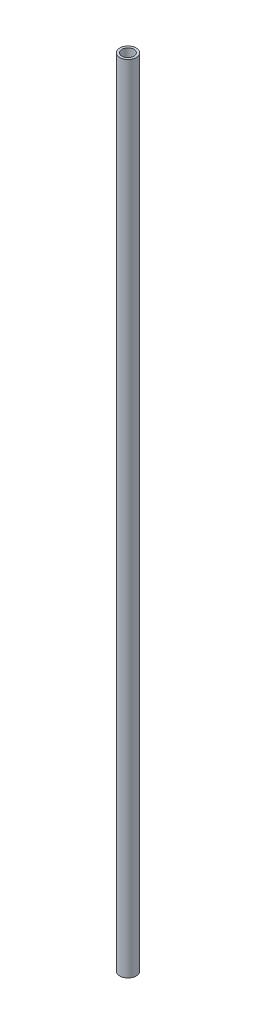
ISO-10303-21;
HEADER;
FILE_DESCRIPTION(('STEP AP214'),'2;1');
FILE_NAME('part.step','',(''),(''),'','','');
FILE_SCHEMA(('AUTOMOTIVE_DESIGN { 1 0 10303 214 1 1 1 1 }'));
ENDSEC;
DATA;
#1=APPLICATION_CONTEXT('core data for automotive mechanical design processes');
#2=APPLICATION_PROTOCOL_DEFINITION('international standard','automotive_design',2000,#1);
#3=PRODUCT_CONTEXT('',#1,'mechanical');
#4=PRODUCT('Part','Part','',(#3));
#5=PRODUCT_RELATED_PRODUCT_CATEGORY('part','',(#4));
#6=PRODUCT_DEFINITION_FORMATION('','',#4);
#7=PRODUCT_DEFINITION_CONTEXT('part definition',#1,'design');
#8=PRODUCT_DEFINITION('design','',#6,#7);
#9=PRODUCT_DEFINITION_SHAPE('','',#8);
#10=(LENGTH_UNIT() NAMED_UNIT(*) SI_UNIT(.MILLI.,.METRE.));
#11=(NAMED_UNIT(*) PLANE_ANGLE_UNIT() SI_UNIT($,.RADIAN.));
#12=(NAMED_UNIT(*) SI_UNIT($,.STERADIAN.) SOLID_ANGLE_UNIT());
#13=UNCERTAINTY_MEASURE_WITH_UNIT(LENGTH_MEASURE(1.E-05),#10,'distance_accuracy_value','');
#14=(GEOMETRIC_REPRESENTATION_CONTEXT(3) GLOBAL_UNCERTAINTY_ASSIGNED_CONTEXT((#13)) GLOBAL_UNIT_ASSIGNED_CONTEXT((#10,
#11,#12)) REPRESENTATION_CONTEXT('',''));
#15=CARTESIAN_POINT('',(0.,0.,0.));
#16=DIRECTION('',(0.,0.,1.));
#17=DIRECTION('',(1.,0.,0.));
#18=AXIS2_PLACEMENT_3D('',#15,#16,#17);
#19=CARTESIAN_POINT('',(0.,304.8,0.));
#20=DIRECTION('',(0.,1.,0.));
#21=DIRECTION('',(0.,0.,1.));
#22=AXIS2_PLACEMENT_3D('',#19,#20,#21);
#23=PLANE('',#22);
#24=CARTESIAN_POINT('',(0.,304.8,0.));
#25=DIRECTION('',(0.,1.,0.));
#26=DIRECTION('',(0.,0.,1.));
#27=AXIS2_PLACEMENT_3D('',#24,#25,#26);
#28=CIRCLE('',#27,3.175);
#29=CARTESIAN_POINT('',(0.,304.8,3.175));
#30=VERTEX_POINT('',#29);
#31=EDGE_CURVE('E10',#30,#30,#28,.T.);
#32=ORIENTED_EDGE('',*,*,#31,.T.);
#33=EDGE_LOOP('',(#32));
#34=FACE_BOUND('',#33,.T.);
#35=CARTESIAN_POINT('',(0.,304.8,0.));
#36=DIRECTION('',(0.,1.,0.));
#37=DIRECTION('',(0.,0.,1.));
#38=AXIS2_PLACEMENT_3D('',#35,#36,#37);
#39=CIRCLE('',#38,2.286);
#40=CARTESIAN_POINT('',(0.,304.8,2.286));
#41=VERTEX_POINT('',#40);
#42=EDGE_CURVE('E50',#41,#41,#39,.T.);
#43=ORIENTED_EDGE('',*,*,#42,.F.);
#44=EDGE_LOOP('',(#43));
#45=FACE_BOUND('',#44,.T.);
#46=ADVANCED_FACE('F37',(#34,#45),#23,.T.);
#47=CARTESIAN_POINT('',(0.,0.,0.));
#48=DIRECTION('',(0.,1.,0.));
#49=DIRECTION('',(0.,0.,1.));
#50=AXIS2_PLACEMENT_3D('',#47,#48,#49);
#51=PLANE('',#50);
#52=CARTESIAN_POINT('',(0.,0.,0.));
#53=DIRECTION('',(0.,1.,0.));
#54=DIRECTION('',(0.,0.,1.));
#55=AXIS2_PLACEMENT_3D('',#52,#53,#54);
#56=CIRCLE('',#55,3.175);
#57=CARTESIAN_POINT('',(0.,0.,3.175));
#58=VERTEX_POINT('',#57);
#59=EDGE_CURVE('E41',#58,#58,#56,.T.);
#60=ORIENTED_EDGE('',*,*,#59,.F.);
#61=EDGE_LOOP('',(#60));
#62=FACE_BOUND('',#61,.T.);
#63=CARTESIAN_POINT('',(0.,0.,0.));
#64=DIRECTION('',(0.,1.,0.));
#65=DIRECTION('',(0.,0.,1.));
#66=AXIS2_PLACEMENT_3D('',#63,#64,#65);
#67=CIRCLE('',#66,2.286);
#68=CARTESIAN_POINT('',(0.,0.,2.286));
#69=VERTEX_POINT('',#68);
#70=EDGE_CURVE('E52',#69,#69,#67,.T.);
#71=ORIENTED_EDGE('',*,*,#70,.T.);
#72=EDGE_LOOP('',(#71));
#73=FACE_BOUND('',#72,.T.);
#74=ADVANCED_FACE('F64',(#62,#73),#51,.F.);
#75=CARTESIAN_POINT('',(0.,304.8,0.));
#76=DIRECTION('',(0.,-1.,0.));
#77=DIRECTION('',(0.,0.,-1.));
#78=AXIS2_PLACEMENT_3D('',#75,#76,#77);
#79=CYLINDRICAL_SURFACE('',#78,3.175);
#80=ORIENTED_EDGE('',*,*,#31,.F.);
#81=EDGE_LOOP('',(#80));
#82=FACE_BOUND('',#81,.T.);
#83=ORIENTED_EDGE('',*,*,#59,.T.);
#84=EDGE_LOOP('',(#83));
#85=FACE_BOUND('',#84,.T.);
#86=ADVANCED_FACE('F39',(#82,#85),#79,.T.);
#87=CARTESIAN_POINT('',(0.,304.8,0.));
#88=DIRECTION('',(0.,-1.,0.));
#89=DIRECTION('',(0.,0.,-1.));
#90=AXIS2_PLACEMENT_3D('',#87,#88,#89);
#91=CYLINDRICAL_SURFACE('',#90,2.286);
#92=ORIENTED_EDGE('',*,*,#42,.T.);
#93=EDGE_LOOP('',(#92));
#94=FACE_BOUND('',#93,.T.);
#95=ORIENTED_EDGE('',*,*,#70,.F.);
#96=EDGE_LOOP('',(#95));
#97=FACE_BOUND('',#96,.T.);
#98=ADVANCED_FACE('F60',(#94,#97),#91,.F.);
#99=CLOSED_SHELL('',(#46,#74,#86,#98));
#100=MANIFOLD_SOLID_BREP('B2',#99);
#101=ADVANCED_BREP_SHAPE_REPRESENTATION('',(#18,#100),#14);
#102=SHAPE_DEFINITION_REPRESENTATION(#9,#101);
ENDSEC;
END-ISO-10303-21;
